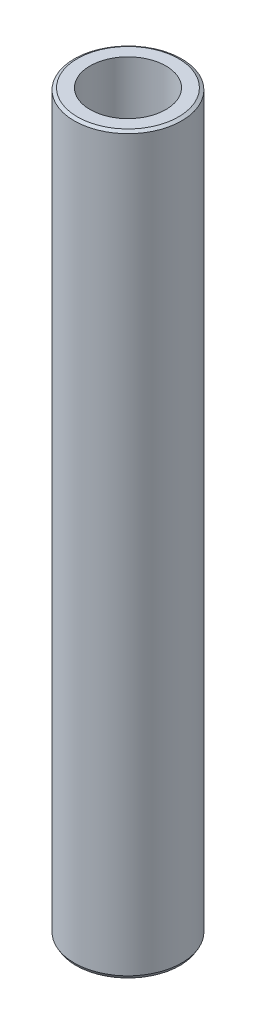
ISO-10303-21;
HEADER;
FILE_DESCRIPTION(('STEP AP214'),'2;1');
FILE_NAME('part.step','',(''),(''),'','','');
FILE_SCHEMA(('AUTOMOTIVE_DESIGN { 1 0 10303 214 1 1 1 1 }'));
ENDSEC;
DATA;
#1=APPLICATION_CONTEXT('core data for automotive mechanical design processes');
#2=APPLICATION_PROTOCOL_DEFINITION('international standard','automotive_design',2000,#1);
#3=PRODUCT_CONTEXT('',#1,'mechanical');
#4=PRODUCT('Part','Part','',(#3));
#5=PRODUCT_RELATED_PRODUCT_CATEGORY('part','',(#4));
#6=PRODUCT_DEFINITION_FORMATION('','',#4);
#7=PRODUCT_DEFINITION_CONTEXT('part definition',#1,'design');
#8=PRODUCT_DEFINITION('design','',#6,#7);
#9=PRODUCT_DEFINITION_SHAPE('','',#8);
#10=(LENGTH_UNIT() NAMED_UNIT(*) SI_UNIT(.MILLI.,.METRE.));
#11=(NAMED_UNIT(*) PLANE_ANGLE_UNIT() SI_UNIT($,.RADIAN.));
#12=(NAMED_UNIT(*) SI_UNIT($,.STERADIAN.) SOLID_ANGLE_UNIT());
#13=UNCERTAINTY_MEASURE_WITH_UNIT(LENGTH_MEASURE(1.E-05),#10,'distance_accuracy_value','');
#14=(GEOMETRIC_REPRESENTATION_CONTEXT(3) GLOBAL_UNCERTAINTY_ASSIGNED_CONTEXT((#13)) GLOBAL_UNIT_ASSIGNED_CONTEXT((#10,
#11,#12)) REPRESENTATION_CONTEXT('',''));
#15=CARTESIAN_POINT('',(0.,0.,0.));
#16=DIRECTION('',(0.,0.,1.));
#17=DIRECTION('',(1.,0.,0.));
#18=AXIS2_PLACEMENT_3D('',#15,#16,#17);
#19=CARTESIAN_POINT('',(0.,375.953701830346,0.));
#20=DIRECTION('',(0.,-1.,0.));
#21=DIRECTION('',(0.,0.,-1.));
#22=AXIS2_PLACEMENT_3D('',#19,#20,#21);
#23=CYLINDRICAL_SURFACE('',#22,27.5);
#24=CARTESIAN_POINT('',(0.,375.014816618803,0.));
#25=DIRECTION('',(0.,1.,0.));
#26=DIRECTION('',(0.,0.,1.));
#27=AXIS2_PLACEMENT_3D('',#24,#25,#26);
#28=CIRCLE('',#27,27.5);
#29=CARTESIAN_POINT('',(0.,375.014816618803,27.5));
#30=VERTEX_POINT('',#29);
#31=EDGE_CURVE('E50',#30,#30,#28,.F.);
#32=ORIENTED_EDGE('',*,*,#31,.T.);
#33=EDGE_LOOP('',(#32));
#34=FACE_BOUND('',#33,.T.);
#35=CARTESIAN_POINT('',(0.,1.62619688886773,0.));
#36=DIRECTION('',(0.,1.,0.));
#37=DIRECTION('',(0.,0.,1.));
#38=AXIS2_PLACEMENT_3D('',#35,#36,#37);
#39=CIRCLE('',#38,27.5);
#40=CARTESIAN_POINT('',(0.,1.62619688886773,27.5));
#41=VERTEX_POINT('',#40);
#42=EDGE_CURVE('E51',#41,#41,#39,.T.);
#43=ORIENTED_EDGE('',*,*,#42,.T.);
#44=EDGE_LOOP('',(#43));
#45=FACE_BOUND('',#44,.T.);
#46=ADVANCED_FACE('F39',(#34,#45),#23,.T.);
#47=CARTESIAN_POINT('',(0.,375.953701830346,0.));
#48=DIRECTION('',(0.,1.,0.));
#49=DIRECTION('',(0.,0.,1.));
#50=AXIS2_PLACEMENT_3D('',#47,#48,#49);
#51=PLANE('',#50);
#52=CARTESIAN_POINT('',(0.,375.953701830346,0.));
#53=DIRECTION('',(0.,1.,0.));
#54=DIRECTION('',(0.,0.,1.));
#55=AXIS2_PLACEMENT_3D('',#52,#53,#54);
#56=CIRCLE('',#55,25.8738031111324);
#57=CARTESIAN_POINT('',(0.,375.953701830346,25.8738031111324));
#58=VERTEX_POINT('',#57);
#59=EDGE_CURVE('E54',#58,#58,#56,.T.);
#60=ORIENTED_EDGE('',*,*,#59,.T.);
#61=EDGE_LOOP('',(#60));
#62=FACE_BOUND('',#61,.T.);
#63=CARTESIAN_POINT('',(0.,375.953701830346,0.));
#64=DIRECTION('',(0.,1.,0.));
#65=DIRECTION('',(0.,0.,1.));
#66=AXIS2_PLACEMENT_3D('',#63,#64,#65);
#67=CIRCLE('',#66,19.3995051759021);
#68=CARTESIAN_POINT('',(0.,375.953701830346,19.3995051759021));
#69=VERTEX_POINT('',#68);
#70=EDGE_CURVE('E58',#69,#69,#67,.T.);
#71=ORIENTED_EDGE('',*,*,#70,.F.);
#72=EDGE_LOOP('',(#71));
#73=FACE_BOUND('',#72,.T.);
#74=ADVANCED_FACE('F69',(#62,#73),#51,.T.);
#75=CARTESIAN_POINT('',(0.,0.,0.));
#76=DIRECTION('',(0.,1.,0.));
#77=DIRECTION('',(0.,0.,1.));
#78=AXIS2_PLACEMENT_3D('',#75,#76,#77);
#79=PLANE('',#78);
#80=CARTESIAN_POINT('',(0.,0.,0.));
#81=DIRECTION('',(0.,1.,0.));
#82=DIRECTION('',(0.,0.,1.));
#83=AXIS2_PLACEMENT_3D('',#80,#81,#82);
#84=CIRCLE('',#83,26.5611147884569);
#85=CARTESIAN_POINT('',(0.,0.,26.5611147884569));
#86=VERTEX_POINT('',#85);
#87=EDGE_CURVE('E10',#86,#86,#84,.F.);
#88=ORIENTED_EDGE('',*,*,#87,.T.);
#89=EDGE_LOOP('',(#88));
#90=FACE_BOUND('',#89,.T.);
#91=CARTESIAN_POINT('',(0.,0.,0.));
#92=DIRECTION('',(0.,1.,0.));
#93=DIRECTION('',(0.,0.,1.));
#94=AXIS2_PLACEMENT_3D('',#91,#92,#93);
#95=CIRCLE('',#94,19.3995051759021);
#96=CARTESIAN_POINT('',(0.,0.,19.3995051759021));
#97=VERTEX_POINT('',#96);
#98=EDGE_CURVE('E63',#97,#97,#95,.T.);
#99=ORIENTED_EDGE('',*,*,#98,.T.);
#100=EDGE_LOOP('',(#99));
#101=FACE_BOUND('',#100,.T.);
#102=ADVANCED_FACE('F75',(#90,#101),#79,.F.);
#103=CARTESIAN_POINT('',(0.,375.953701830346,0.));
#104=DIRECTION('',(0.,-1.,0.));
#105=DIRECTION('',(0.,0.,-1.));
#106=AXIS2_PLACEMENT_3D('',#103,#104,#105);
#107=CYLINDRICAL_SURFACE('',#106,19.3995051759021);
#108=ORIENTED_EDGE('',*,*,#70,.T.);
#109=EDGE_LOOP('',(#108));
#110=FACE_BOUND('',#109,.T.);
#111=ORIENTED_EDGE('',*,*,#98,.F.);
#112=EDGE_LOOP('',(#111));
#113=FACE_BOUND('',#112,.T.);
#114=ADVANCED_FACE('F70',(#110,#113),#107,.F.);
#115=CARTESIAN_POINT('',(0.,375.953701830346,0.));
#116=DIRECTION('',(0.,-1.,0.));
#117=DIRECTION('',(0.,0.,-1.));
#118=AXIS2_PLACEMENT_3D('',#115,#116,#117);
#119=CONICAL_SURFACE('',#118,25.8738031111324,1.04719755119663);
#120=ORIENTED_EDGE('',*,*,#31,.F.);
#121=EDGE_LOOP('',(#120));
#122=FACE_BOUND('',#121,.T.);
#123=ORIENTED_EDGE('',*,*,#59,.F.);
#124=EDGE_LOOP('',(#123));
#125=FACE_BOUND('',#124,.T.);
#126=ADVANCED_FACE('F81',(#122,#125),#119,.T.);
#127=CARTESIAN_POINT('',(0.,1.62619688886773,0.));
#128=DIRECTION('',(0.,1.,0.));
#129=DIRECTION('',(0.,0.,1.));
#130=AXIS2_PLACEMENT_3D('',#127,#128,#129);
#131=CONICAL_SURFACE('',#130,27.5,0.523598775598291);
#132=ORIENTED_EDGE('',*,*,#87,.F.);
#133=EDGE_LOOP('',(#132));
#134=FACE_BOUND('',#133,.T.);
#135=ORIENTED_EDGE('',*,*,#42,.F.);
#136=EDGE_LOOP('',(#135));
#137=FACE_BOUND('',#136,.T.);
#138=ADVANCED_FACE('F45',(#134,#137),#131,.T.);
#139=CLOSED_SHELL('',(#46,#74,#102,#114,#126,#138));
#140=MANIFOLD_SOLID_BREP('B2',#139);
#141=ADVANCED_BREP_SHAPE_REPRESENTATION('',(#18,#140),#14);
#142=SHAPE_DEFINITION_REPRESENTATION(#9,#141);
ENDSEC;
END-ISO-10303-21;
